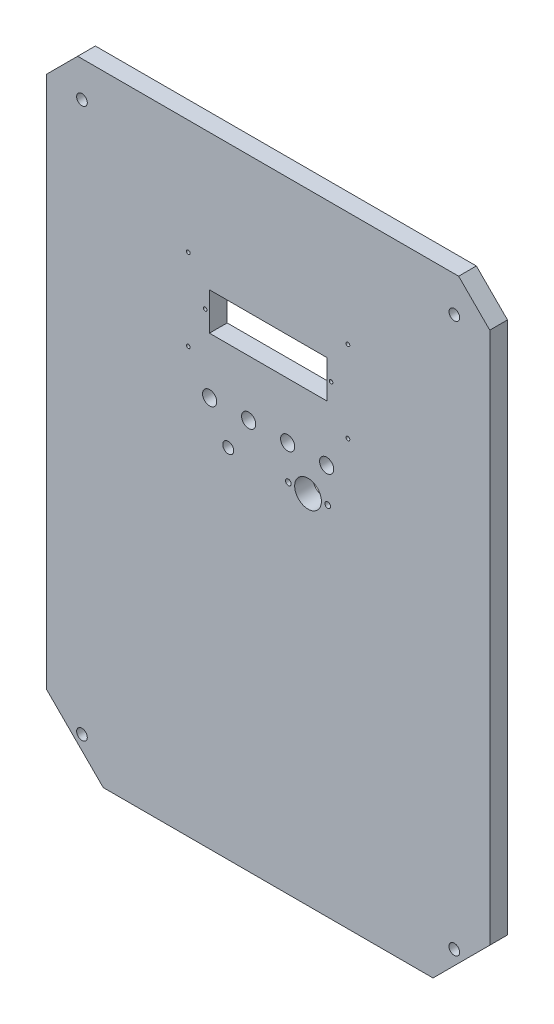
ISO-10303-21;
HEADER;
FILE_DESCRIPTION(('STEP AP214'),'2;1');
FILE_NAME('part.step','',(''),(''),'','','');
FILE_SCHEMA(('AUTOMOTIVE_DESIGN { 1 0 10303 214 1 1 1 1 }'));
ENDSEC;
DATA;
#1=APPLICATION_CONTEXT('core data for automotive mechanical design processes');
#2=APPLICATION_PROTOCOL_DEFINITION('international standard','automotive_design',2000,#1);
#3=PRODUCT_CONTEXT('',#1,'mechanical');
#4=PRODUCT('Part','Part','',(#3));
#5=PRODUCT_RELATED_PRODUCT_CATEGORY('part','',(#4));
#6=PRODUCT_DEFINITION_FORMATION('','',#4);
#7=PRODUCT_DEFINITION_CONTEXT('part definition',#1,'design');
#8=PRODUCT_DEFINITION('design','',#6,#7);
#9=PRODUCT_DEFINITION_SHAPE('','',#8);
#10=(LENGTH_UNIT() NAMED_UNIT(*) SI_UNIT(.MILLI.,.METRE.));
#11=(NAMED_UNIT(*) PLANE_ANGLE_UNIT() SI_UNIT($,.RADIAN.));
#12=(NAMED_UNIT(*) SI_UNIT($,.STERADIAN.) SOLID_ANGLE_UNIT());
#13=UNCERTAINTY_MEASURE_WITH_UNIT(LENGTH_MEASURE(1.E-05),#10,'distance_accuracy_value','');
#14=(GEOMETRIC_REPRESENTATION_CONTEXT(3) GLOBAL_UNCERTAINTY_ASSIGNED_CONTEXT((#13)) GLOBAL_UNIT_ASSIGNED_CONTEXT((#10,
#11,#12)) REPRESENTATION_CONTEXT('',''));
#15=CARTESIAN_POINT('',(0.,0.,0.));
#16=DIRECTION('',(0.,0.,1.));
#17=DIRECTION('',(1.,0.,0.));
#18=AXIS2_PLACEMENT_3D('',#15,#16,#17);
#19=CARTESIAN_POINT('',(939.601426779107,522.610093658204,10.));
#20=DIRECTION('',(0.,0.,1.));
#21=DIRECTION('',(1.,0.,0.));
#22=AXIS2_PLACEMENT_3D('',#19,#20,#21);
#23=PLANE('',#22);
#24=CARTESIAN_POINT('',(781.601426779108,743.015433658205,10.));
#25=DIRECTION('',(0.,0.,1.));
#26=DIRECTION('',(1.,0.,0.));
#27=AXIS2_PLACEMENT_3D('',#24,#25,#26);
#28=CIRCLE('',#27,3.99999999999999);
#29=CARTESIAN_POINT('',(785.601426779108,743.015433658205,10.));
#30=VERTEX_POINT('',#29);
#31=EDGE_CURVE('E370',#30,#30,#28,.T.);
#32=ORIENTED_EDGE('',*,*,#31,.F.);
#33=EDGE_LOOP('',(#32));
#34=FACE_BOUND('',#33,.T.);
#35=CARTESIAN_POINT('',(825.601426779108,743.015433658205,10.));
#36=DIRECTION('',(0.,0.,1.));
#37=DIRECTION('',(1.,0.,0.));
#38=AXIS2_PLACEMENT_3D('',#35,#36,#37);
#39=CIRCLE('',#38,3.99999999999999);
#40=CARTESIAN_POINT('',(829.601426779108,743.015433658205,10.));
#41=VERTEX_POINT('',#40);
#42=EDGE_CURVE('E380',#41,#41,#39,.T.);
#43=ORIENTED_EDGE('',*,*,#42,.F.);
#44=EDGE_LOOP('',(#43));
#45=FACE_BOUND('',#44,.T.);
#46=CARTESIAN_POINT('',(848.201426779108,723.920773658205,10.));
#47=DIRECTION('',(0.,0.,1.));
#48=DIRECTION('',(1.,0.,0.));
#49=AXIS2_PLACEMENT_3D('',#46,#47,#48);
#50=CIRCLE('',#49,1.60000000000003);
#51=CARTESIAN_POINT('',(849.801426779108,723.920773658205,10.));
#52=VERTEX_POINT('',#51);
#53=EDGE_CURVE('E390',#52,#52,#50,.T.);
#54=ORIENTED_EDGE('',*,*,#53,.F.);
#55=EDGE_LOOP('',(#54));
#56=FACE_BOUND('',#55,.T.);
#57=CARTESIAN_POINT('',(837.101426779108,723.920773658205,10.));
#58=DIRECTION('',(0.,0.,1.));
#59=DIRECTION('',(1.,0.,0.));
#60=AXIS2_PLACEMENT_3D('',#57,#58,#59);
#61=CIRCLE('',#60,7.54999999999997);
#62=CARTESIAN_POINT('',(844.651426779108,723.920773658205,10.));
#63=VERTEX_POINT('',#62);
#64=EDGE_CURVE('E400',#63,#63,#61,.T.);
#65=ORIENTED_EDGE('',*,*,#64,.F.);
#66=EDGE_LOOP('',(#65));
#67=FACE_BOUND('',#66,.T.);
#68=CARTESIAN_POINT('',(850.101426779108,785.110093658205,10.));
#69=DIRECTION('',(0.,0.,1.));
#70=DIRECTION('',(1.,0.,0.));
#71=AXIS2_PLACEMENT_3D('',#68,#69,#70);
#72=CIRCLE('',#71,0.999999999999945);
#73=CARTESIAN_POINT('',(851.101426779108,785.110093658205,10.));
#74=VERTEX_POINT('',#73);
#75=EDGE_CURVE('E149',#74,#74,#72,.T.);
#76=ORIENTED_EDGE('',*,*,#75,.F.);
#77=EDGE_LOOP('',(#76));
#78=FACE_BOUND('',#77,.T.);
#79=CARTESIAN_POINT('',(859.601426779108,762.110093658205,10.));
#80=DIRECTION('',(0.,0.,1.));
#81=DIRECTION('',(-1.,0.,0.));
#82=AXIS2_PLACEMENT_3D('',#79,#80,#81);
#83=CIRCLE('',#82,1.04999999999996);
#84=CARTESIAN_POINT('',(858.551426779108,762.110093658205,10.));
#85=VERTEX_POINT('',#84);
#86=EDGE_CURVE('E159',#85,#85,#83,.T.);
#87=ORIENTED_EDGE('',*,*,#86,.F.);
#88=EDGE_LOOP('',(#87));
#89=FACE_BOUND('',#88,.T.);
#90=CARTESIAN_POINT('',(769.601426779108,808.110093658205,10.));
#91=DIRECTION('',(0.,0.,1.));
#92=DIRECTION('',(-1.,0.,0.));
#93=AXIS2_PLACEMENT_3D('',#90,#91,#92);
#94=CIRCLE('',#93,1.04999999999996);
#95=CARTESIAN_POINT('',(768.551426779108,808.110093658205,10.));
#96=VERTEX_POINT('',#95);
#97=EDGE_CURVE('E171',#96,#96,#94,.T.);
#98=ORIENTED_EDGE('',*,*,#97,.F.);
#99=EDGE_LOOP('',(#98));
#100=FACE_BOUND('',#99,.T.);
#101=CARTESIAN_POINT('',(919.601426779107,542.610093658204,10.));
#102=DIRECTION('',(0.,0.,1.));
#103=DIRECTION('',(1.,0.,0.));
#104=AXIS2_PLACEMENT_3D('',#101,#102,#103);
#105=CIRCLE('',#104,3.00000000000096);
#106=CARTESIAN_POINT('',(922.601426779108,542.610093658204,10.));
#107=VERTEX_POINT('',#106);
#108=EDGE_CURVE('E183',#107,#107,#105,.T.);
#109=ORIENTED_EDGE('',*,*,#108,.F.);
#110=EDGE_LOOP('',(#109));
#111=FACE_BOUND('',#110,.T.);
#112=CARTESIAN_POINT('',(709.601426779108,852.610093658205,10.));
#113=DIRECTION('',(0.,0.,1.));
#114=DIRECTION('',(1.,0.,0.));
#115=AXIS2_PLACEMENT_3D('',#112,#113,#114);
#116=CIRCLE('',#115,2.99999999999995);
#117=CARTESIAN_POINT('',(712.601426779108,852.610093658205,10.));
#118=VERTEX_POINT('',#117);
#119=EDGE_CURVE('E195',#118,#118,#116,.T.);
#120=ORIENTED_EDGE('',*,*,#119,.F.);
#121=EDGE_LOOP('',(#120));
#122=FACE_BOUND('',#121,.T.);
#123=DIRECTION('',(1.,0.,0.));
#124=VECTOR('',#123,1.);
#125=CARTESIAN_POINT('',(721.601426779107,522.610093658204,10.));
#126=LINE('',#125,#124);
#127=CARTESIAN_POINT('',(721.601426779107,522.610093658204,10.));
#128=VERTEX_POINT('',#127);
#129=CARTESIAN_POINT('',(907.601426779108,522.610093658204,10.));
#130=VERTEX_POINT('',#129);
#131=EDGE_CURVE('E207',#128,#130,#126,.T.);
#132=ORIENTED_EDGE('',*,*,#131,.T.);
#133=DIRECTION('',(0.707106781186544,0.707106781186551,0.));
#134=VECTOR('',#133,1.);
#135=CARTESIAN_POINT('',(907.601426779108,522.610093658204,10.));
#136=LINE('',#135,#134);
#137=CARTESIAN_POINT('',(939.601426779107,554.610093658204,10.));
#138=VERTEX_POINT('',#137);
#139=EDGE_CURVE('E210',#130,#138,#136,.T.);
#140=ORIENTED_EDGE('',*,*,#139,.T.);
#141=DIRECTION('',(0.,1.,0.));
#142=VECTOR('',#141,1.);
#143=CARTESIAN_POINT('',(939.601426779107,554.610093658204,10.));
#144=LINE('',#143,#142);
#145=CARTESIAN_POINT('',(939.601426779108,855.042708992512,10.));
#146=VERTEX_POINT('',#145);
#147=EDGE_CURVE('E213',#138,#146,#144,.T.);
#148=ORIENTED_EDGE('',*,*,#147,.T.);
#149=DIRECTION('',(-0.707106781186543,0.707106781186552,0.));
#150=VECTOR('',#149,1.);
#151=CARTESIAN_POINT('',(939.601426779108,855.042708992512,10.));
#152=LINE('',#151,#150);
#153=CARTESIAN_POINT('',(922.034042113416,872.610093658205,10.));
#154=VERTEX_POINT('',#153);
#155=EDGE_CURVE('E215',#146,#154,#152,.T.);
#156=ORIENTED_EDGE('',*,*,#155,.T.);
#157=DIRECTION('',(-1.,0.,0.));
#158=VECTOR('',#157,1.);
#159=CARTESIAN_POINT('',(922.034042113416,872.610093658205,10.));
#160=LINE('',#159,#158);
#161=CARTESIAN_POINT('',(707.1688114448,872.610093658205,10.));
#162=VERTEX_POINT('',#161);
#163=EDGE_CURVE('E217',#154,#162,#160,.T.);
#164=ORIENTED_EDGE('',*,*,#163,.T.);
#165=DIRECTION('',(-0.707106781186543,-0.707106781186552,0.));
#166=VECTOR('',#165,1.);
#167=CARTESIAN_POINT('',(707.1688114448,872.610093658205,10.));
#168=LINE('',#167,#166);
#169=CARTESIAN_POINT('',(689.601426779108,855.042708992512,10.));
#170=VERTEX_POINT('',#169);
#171=EDGE_CURVE('E219',#162,#170,#168,.T.);
#172=ORIENTED_EDGE('',*,*,#171,.T.);
#173=DIRECTION('',(0.,-1.,0.));
#174=VECTOR('',#173,1.);
#175=CARTESIAN_POINT('',(689.601426779108,855.042708992512,10.));
#176=LINE('',#175,#174);
#177=CARTESIAN_POINT('',(689.601426779108,554.610093658205,10.));
#178=VERTEX_POINT('',#177);
#179=EDGE_CURVE('E221',#170,#178,#176,.T.);
#180=ORIENTED_EDGE('',*,*,#179,.T.);
#181=DIRECTION('',(0.707106781186541,-0.707106781186554,0.));
#182=VECTOR('',#181,1.);
#183=CARTESIAN_POINT('',(689.601426779108,554.610093658205,10.));
#184=LINE('',#183,#182);
#185=EDGE_CURVE('E223',#178,#128,#184,.T.);
#186=ORIENTED_EDGE('',*,*,#185,.T.);
#187=EDGE_LOOP('',(#132,#140,#148,#156,#164,#172,#180,#186));
#188=FACE_BOUND('',#187,.T.);
#189=CARTESIAN_POINT('',(709.601426779107,542.610093658205,10.));
#190=DIRECTION('',(0.,0.,1.));
#191=DIRECTION('',(1.,0.,0.));
#192=AXIS2_PLACEMENT_3D('',#189,#190,#191);
#193=CIRCLE('',#192,3.00000000000051);
#194=CARTESIAN_POINT('',(712.601426779108,542.610093658205,10.));
#195=VERTEX_POINT('',#194);
#196=EDGE_CURVE('E201',#195,#195,#193,.T.);
#197=ORIENTED_EDGE('',*,*,#196,.F.);
#198=EDGE_LOOP('',(#197));
#199=FACE_BOUND('',#198,.T.);
#200=CARTESIAN_POINT('',(919.601426779108,852.610093658204,10.));
#201=DIRECTION('',(0.,0.,1.));
#202=DIRECTION('',(1.,0.,0.));
#203=AXIS2_PLACEMENT_3D('',#200,#201,#202);
#204=CIRCLE('',#203,2.9999999999999);
#205=CARTESIAN_POINT('',(922.601426779108,852.610093658204,10.));
#206=VERTEX_POINT('',#205);
#207=EDGE_CURVE('E189',#206,#206,#204,.T.);
#208=ORIENTED_EDGE('',*,*,#207,.F.);
#209=EDGE_LOOP('',(#208));
#210=FACE_BOUND('',#209,.T.);
#211=CARTESIAN_POINT('',(859.601426779108,808.110093658205,10.));
#212=DIRECTION('',(0.,0.,1.));
#213=DIRECTION('',(1.,0.,0.));
#214=AXIS2_PLACEMENT_3D('',#211,#212,#213);
#215=CIRCLE('',#214,1.04999999999975);
#216=CARTESIAN_POINT('',(860.651426779108,808.110093658205,10.));
#217=VERTEX_POINT('',#216);
#218=EDGE_CURVE('E177',#217,#217,#215,.T.);
#219=ORIENTED_EDGE('',*,*,#218,.F.);
#220=EDGE_LOOP('',(#219));
#221=FACE_BOUND('',#220,.T.);
#222=CARTESIAN_POINT('',(769.601426779108,762.110093658205,10.));
#223=DIRECTION('',(0.,0.,1.));
#224=DIRECTION('',(1.,0.,0.));
#225=AXIS2_PLACEMENT_3D('',#222,#223,#224);
#226=CIRCLE('',#225,1.04999999999996);
#227=CARTESIAN_POINT('',(770.651426779108,762.110093658205,10.));
#228=VERTEX_POINT('',#227);
#229=EDGE_CURVE('E165',#228,#228,#226,.T.);
#230=ORIENTED_EDGE('',*,*,#229,.F.);
#231=EDGE_LOOP('',(#230));
#232=FACE_BOUND('',#231,.T.);
#233=DIRECTION('',(1.,0.,0.));
#234=VECTOR('',#233,1.);
#235=CARTESIAN_POINT('',(847.701426779108,774.510093658205,10.));
#236=LINE('',#235,#234);
#237=CARTESIAN_POINT('',(781.501426779108,774.510093658205,10.));
#238=VERTEX_POINT('',#237);
#239=CARTESIAN_POINT('',(847.701426779108,774.510093658205,10.));
#240=VERTEX_POINT('',#239);
#241=EDGE_CURVE('E128',#238,#240,#236,.T.);
#242=ORIENTED_EDGE('',*,*,#241,.F.);
#243=DIRECTION('',(0.,-1.,0.));
#244=VECTOR('',#243,1.);
#245=CARTESIAN_POINT('',(781.501426779108,795.710093658205,10.));
#246=LINE('',#245,#244);
#247=CARTESIAN_POINT('',(781.501426779108,795.710093658205,10.));
#248=VERTEX_POINT('',#247);
#249=EDGE_CURVE('E120',#248,#238,#246,.T.);
#250=ORIENTED_EDGE('',*,*,#249,.F.);
#251=DIRECTION('',(-1.,0.,0.));
#252=VECTOR('',#251,1.);
#253=CARTESIAN_POINT('',(847.701426779108,795.710093658205,10.));
#254=LINE('',#253,#252);
#255=CARTESIAN_POINT('',(847.701426779108,795.710093658205,10.));
#256=VERTEX_POINT('',#255);
#257=EDGE_CURVE('E143',#256,#248,#254,.T.);
#258=ORIENTED_EDGE('',*,*,#257,.F.);
#259=DIRECTION('',(0.,1.,0.));
#260=VECTOR('',#259,1.);
#261=CARTESIAN_POINT('',(847.701426779108,795.710093658205,10.));
#262=LINE('',#261,#260);
#263=EDGE_CURVE('E141',#240,#256,#262,.T.);
#264=ORIENTED_EDGE('',*,*,#263,.F.);
#265=EDGE_LOOP('',(#242,#250,#258,#264));
#266=FACE_BOUND('',#265,.T.);
#267=CARTESIAN_POINT('',(779.101426779108,785.110093658205,10.));
#268=DIRECTION('',(0.,0.,1.));
#269=DIRECTION('',(-1.,0.,0.));
#270=AXIS2_PLACEMENT_3D('',#267,#268,#269);
#271=CIRCLE('',#270,1.00000000000005);
#272=CARTESIAN_POINT('',(778.101426779108,785.110093658205,10.));
#273=VERTEX_POINT('',#272);
#274=EDGE_CURVE('E405',#273,#273,#271,.T.);
#275=ORIENTED_EDGE('',*,*,#274,.F.);
#276=EDGE_LOOP('',(#275));
#277=FACE_BOUND('',#276,.T.);
#278=CARTESIAN_POINT('',(847.601426779108,743.015433658205,10.));
#279=DIRECTION('',(0.,0.,1.));
#280=DIRECTION('',(1.,0.,0.));
#281=AXIS2_PLACEMENT_3D('',#278,#279,#280);
#282=CIRCLE('',#281,3.99999999999999);
#283=CARTESIAN_POINT('',(851.601426779108,743.015433658205,10.));
#284=VERTEX_POINT('',#283);
#285=EDGE_CURVE('E395',#284,#284,#282,.T.);
#286=ORIENTED_EDGE('',*,*,#285,.F.);
#287=EDGE_LOOP('',(#286));
#288=FACE_BOUND('',#287,.T.);
#289=CARTESIAN_POINT('',(826.001426779108,723.920773658205,10.));
#290=DIRECTION('',(0.,0.,1.));
#291=DIRECTION('',(1.,0.,0.));
#292=AXIS2_PLACEMENT_3D('',#289,#290,#291);
#293=CIRCLE('',#292,1.60000000000003);
#294=CARTESIAN_POINT('',(827.601426779108,723.920773658205,10.));
#295=VERTEX_POINT('',#294);
#296=EDGE_CURVE('E385',#295,#295,#293,.T.);
#297=ORIENTED_EDGE('',*,*,#296,.F.);
#298=EDGE_LOOP('',(#297));
#299=FACE_BOUND('',#298,.T.);
#300=CARTESIAN_POINT('',(803.601426779108,743.015433658205,10.));
#301=DIRECTION('',(0.,0.,1.));
#302=DIRECTION('',(1.,0.,0.));
#303=AXIS2_PLACEMENT_3D('',#300,#301,#302);
#304=CIRCLE('',#303,3.99999999999999);
#305=CARTESIAN_POINT('',(807.601426779108,743.015433658205,10.));
#306=VERTEX_POINT('',#305);
#307=EDGE_CURVE('E375',#306,#306,#304,.T.);
#308=ORIENTED_EDGE('',*,*,#307,.F.);
#309=EDGE_LOOP('',(#308));
#310=FACE_BOUND('',#309,.T.);
#311=CARTESIAN_POINT('',(792.101426779108,723.920773658205,10.));
#312=DIRECTION('',(0.,0.,1.));
#313=DIRECTION('',(1.,0.,0.));
#314=AXIS2_PLACEMENT_3D('',#311,#312,#313);
#315=CIRCLE('',#314,3.1);
#316=CARTESIAN_POINT('',(795.201426779108,723.920773658205,10.));
#317=VERTEX_POINT('',#316);
#318=EDGE_CURVE('E364',#317,#317,#315,.T.);
#319=ORIENTED_EDGE('',*,*,#318,.F.);
#320=EDGE_LOOP('',(#319));
#321=FACE_BOUND('',#320,.T.);
#322=ADVANCED_FACE('F31',(#34,#45,#56,#67,#78,#89,#100,#111,#122,#188,#199,#210,#221,#232,#266,
#277,#288,#299,#310,#321),#23,.T.);
#323=CARTESIAN_POINT('',(939.601426779107,522.610093658204,0.));
#324=DIRECTION('',(0.,0.,1.));
#325=DIRECTION('',(1.,0.,0.));
#326=AXIS2_PLACEMENT_3D('',#323,#324,#325);
#327=PLANE('',#326);
#328=CARTESIAN_POINT('',(781.601426779108,743.015433658205,0.));
#329=DIRECTION('',(0.,0.,1.));
#330=DIRECTION('',(1.,0.,0.));
#331=AXIS2_PLACEMENT_3D('',#328,#329,#330);
#332=CIRCLE('',#331,3.99999999999999);
#333=CARTESIAN_POINT('',(785.601426779108,743.015433658205,0.));
#334=VERTEX_POINT('',#333);
#335=EDGE_CURVE('E367',#334,#334,#332,.T.);
#336=ORIENTED_EDGE('',*,*,#335,.T.);
#337=EDGE_LOOP('',(#336));
#338=FACE_BOUND('',#337,.T.);
#339=CARTESIAN_POINT('',(825.601426779108,743.015433658205,0.));
#340=DIRECTION('',(0.,0.,1.));
#341=DIRECTION('',(1.,0.,0.));
#342=AXIS2_PLACEMENT_3D('',#339,#340,#341);
#343=CIRCLE('',#342,3.99999999999999);
#344=CARTESIAN_POINT('',(829.601426779108,743.015433658205,0.));
#345=VERTEX_POINT('',#344);
#346=EDGE_CURVE('E378',#345,#345,#343,.T.);
#347=ORIENTED_EDGE('',*,*,#346,.T.);
#348=EDGE_LOOP('',(#347));
#349=FACE_BOUND('',#348,.T.);
#350=CARTESIAN_POINT('',(848.201426779108,723.920773658205,0.));
#351=DIRECTION('',(0.,0.,1.));
#352=DIRECTION('',(1.,0.,0.));
#353=AXIS2_PLACEMENT_3D('',#350,#351,#352);
#354=CIRCLE('',#353,1.60000000000003);
#355=CARTESIAN_POINT('',(849.801426779108,723.920773658205,0.));
#356=VERTEX_POINT('',#355);
#357=EDGE_CURVE('E388',#356,#356,#354,.T.);
#358=ORIENTED_EDGE('',*,*,#357,.T.);
#359=EDGE_LOOP('',(#358));
#360=FACE_BOUND('',#359,.T.);
#361=CARTESIAN_POINT('',(837.101426779108,723.920773658205,0.));
#362=DIRECTION('',(0.,0.,1.));
#363=DIRECTION('',(1.,0.,0.));
#364=AXIS2_PLACEMENT_3D('',#361,#362,#363);
#365=CIRCLE('',#364,7.54999999999997);
#366=CARTESIAN_POINT('',(844.651426779108,723.920773658205,0.));
#367=VERTEX_POINT('',#366);
#368=EDGE_CURVE('E398',#367,#367,#365,.T.);
#369=ORIENTED_EDGE('',*,*,#368,.T.);
#370=EDGE_LOOP('',(#369));
#371=FACE_BOUND('',#370,.T.);
#372=CARTESIAN_POINT('',(850.101426779108,785.110093658205,0.));
#373=DIRECTION('',(0.,0.,1.));
#374=DIRECTION('',(1.,0.,0.));
#375=AXIS2_PLACEMENT_3D('',#372,#373,#374);
#376=CIRCLE('',#375,0.999999999999945);
#377=CARTESIAN_POINT('',(851.101426779108,785.110093658205,0.));
#378=VERTEX_POINT('',#377);
#379=EDGE_CURVE('E408',#378,#378,#376,.T.);
#380=ORIENTED_EDGE('',*,*,#379,.T.);
#381=EDGE_LOOP('',(#380));
#382=FACE_BOUND('',#381,.T.);
#383=CARTESIAN_POINT('',(859.601426779108,762.110093658205,0.));
#384=DIRECTION('',(0.,0.,1.));
#385=DIRECTION('',(-1.,0.,0.));
#386=AXIS2_PLACEMENT_3D('',#383,#384,#385);
#387=CIRCLE('',#386,1.04999999999996);
#388=CARTESIAN_POINT('',(858.551426779108,762.110093658205,0.));
#389=VERTEX_POINT('',#388);
#390=EDGE_CURVE('E136',#389,#389,#387,.T.);
#391=ORIENTED_EDGE('',*,*,#390,.T.);
#392=EDGE_LOOP('',(#391));
#393=FACE_BOUND('',#392,.T.);
#394=CARTESIAN_POINT('',(769.601426779108,808.110093658205,0.));
#395=DIRECTION('',(0.,0.,1.));
#396=DIRECTION('',(-1.,0.,0.));
#397=AXIS2_PLACEMENT_3D('',#394,#395,#396);
#398=CIRCLE('',#397,1.04999999999996);
#399=CARTESIAN_POINT('',(768.551426779108,808.110093658205,0.));
#400=VERTEX_POINT('',#399);
#401=EDGE_CURVE('E168',#400,#400,#398,.T.);
#402=ORIENTED_EDGE('',*,*,#401,.T.);
#403=EDGE_LOOP('',(#402));
#404=FACE_BOUND('',#403,.T.);
#405=CARTESIAN_POINT('',(919.601426779107,542.610093658204,0.));
#406=DIRECTION('',(0.,0.,1.));
#407=DIRECTION('',(1.,0.,0.));
#408=AXIS2_PLACEMENT_3D('',#405,#406,#407);
#409=CIRCLE('',#408,3.00000000000096);
#410=CARTESIAN_POINT('',(922.601426779108,542.610093658204,0.));
#411=VERTEX_POINT('',#410);
#412=EDGE_CURVE('E180',#411,#411,#409,.T.);
#413=ORIENTED_EDGE('',*,*,#412,.T.);
#414=EDGE_LOOP('',(#413));
#415=FACE_BOUND('',#414,.T.);
#416=CARTESIAN_POINT('',(709.601426779108,852.610093658205,0.));
#417=DIRECTION('',(0.,0.,1.));
#418=DIRECTION('',(1.,0.,0.));
#419=AXIS2_PLACEMENT_3D('',#416,#417,#418);
#420=CIRCLE('',#419,2.99999999999995);
#421=CARTESIAN_POINT('',(712.601426779108,852.610093658205,0.));
#422=VERTEX_POINT('',#421);
#423=EDGE_CURVE('E192',#422,#422,#420,.T.);
#424=ORIENTED_EDGE('',*,*,#423,.T.);
#425=EDGE_LOOP('',(#424));
#426=FACE_BOUND('',#425,.T.);
#427=DIRECTION('',(1.,0.,0.));
#428=VECTOR('',#427,1.);
#429=CARTESIAN_POINT('',(721.601426779107,522.610093658204,0.));
#430=LINE('',#429,#428);
#431=CARTESIAN_POINT('',(721.601426779107,522.610093658204,0.));
#432=VERTEX_POINT('',#431);
#433=CARTESIAN_POINT('',(907.601426779108,522.610093658204,0.));
#434=VERTEX_POINT('',#433);
#435=EDGE_CURVE('E204',#432,#434,#430,.T.);
#436=ORIENTED_EDGE('',*,*,#435,.F.);
#437=DIRECTION('',(0.707106781186541,-0.707106781186554,0.));
#438=VECTOR('',#437,1.);
#439=CARTESIAN_POINT('',(689.601426779108,554.610093658205,0.));
#440=LINE('',#439,#438);
#441=CARTESIAN_POINT('',(689.601426779108,554.610093658205,0.));
#442=VERTEX_POINT('',#441);
#443=EDGE_CURVE('E211',#442,#432,#440,.T.);
#444=ORIENTED_EDGE('',*,*,#443,.F.);
#445=DIRECTION('',(0.,-1.,0.));
#446=VECTOR('',#445,1.);
#447=CARTESIAN_POINT('',(689.601426779108,855.042708992512,0.));
#448=LINE('',#447,#446);
#449=CARTESIAN_POINT('',(689.601426779108,855.042708992512,0.));
#450=VERTEX_POINT('',#449);
#451=EDGE_CURVE('E238',#450,#442,#448,.T.);
#452=ORIENTED_EDGE('',*,*,#451,.F.);
#453=DIRECTION('',(-0.707106781186543,-0.707106781186552,0.));
#454=VECTOR('',#453,1.);
#455=CARTESIAN_POINT('',(707.1688114448,872.610093658205,0.));
#456=LINE('',#455,#454);
#457=CARTESIAN_POINT('',(707.1688114448,872.610093658205,0.));
#458=VERTEX_POINT('',#457);
#459=EDGE_CURVE('E236',#458,#450,#456,.T.);
#460=ORIENTED_EDGE('',*,*,#459,.F.);
#461=DIRECTION('',(-1.,0.,0.));
#462=VECTOR('',#461,1.);
#463=CARTESIAN_POINT('',(922.034042113416,872.610093658205,0.));
#464=LINE('',#463,#462);
#465=CARTESIAN_POINT('',(922.034042113416,872.610093658205,0.));
#466=VERTEX_POINT('',#465);
#467=EDGE_CURVE('E234',#466,#458,#464,.T.);
#468=ORIENTED_EDGE('',*,*,#467,.F.);
#469=DIRECTION('',(-0.707106781186543,0.707106781186552,0.));
#470=VECTOR('',#469,1.);
#471=CARTESIAN_POINT('',(939.601426779108,855.042708992512,0.));
#472=LINE('',#471,#470);
#473=CARTESIAN_POINT('',(939.601426779108,855.042708992512,0.));
#474=VERTEX_POINT('',#473);
#475=EDGE_CURVE('E232',#474,#466,#472,.T.);
#476=ORIENTED_EDGE('',*,*,#475,.F.);
#477=DIRECTION('',(0.,1.,0.));
#478=VECTOR('',#477,1.);
#479=CARTESIAN_POINT('',(939.601426779107,554.610093658204,0.));
#480=LINE('',#479,#478);
#481=CARTESIAN_POINT('',(939.601426779107,554.610093658204,0.));
#482=VERTEX_POINT('',#481);
#483=EDGE_CURVE('E230',#482,#474,#480,.T.);
#484=ORIENTED_EDGE('',*,*,#483,.F.);
#485=DIRECTION('',(0.707106781186544,0.707106781186551,0.));
#486=VECTOR('',#485,1.);
#487=CARTESIAN_POINT('',(907.601426779108,522.610093658204,0.));
#488=LINE('',#487,#486);
#489=EDGE_CURVE('E228',#434,#482,#488,.T.);
#490=ORIENTED_EDGE('',*,*,#489,.F.);
#491=EDGE_LOOP('',(#436,#444,#452,#460,#468,#476,#484,#490));
#492=FACE_BOUND('',#491,.T.);
#493=CARTESIAN_POINT('',(709.601426779107,542.610093658205,0.));
#494=DIRECTION('',(0.,0.,1.));
#495=DIRECTION('',(1.,0.,0.));
#496=AXIS2_PLACEMENT_3D('',#493,#494,#495);
#497=CIRCLE('',#496,3.00000000000051);
#498=CARTESIAN_POINT('',(712.601426779108,542.610093658205,0.));
#499=VERTEX_POINT('',#498);
#500=EDGE_CURVE('E198',#499,#499,#497,.T.);
#501=ORIENTED_EDGE('',*,*,#500,.T.);
#502=EDGE_LOOP('',(#501));
#503=FACE_BOUND('',#502,.T.);
#504=CARTESIAN_POINT('',(919.601426779108,852.610093658204,0.));
#505=DIRECTION('',(0.,0.,1.));
#506=DIRECTION('',(1.,0.,0.));
#507=AXIS2_PLACEMENT_3D('',#504,#505,#506);
#508=CIRCLE('',#507,2.9999999999999);
#509=CARTESIAN_POINT('',(922.601426779108,852.610093658204,0.));
#510=VERTEX_POINT('',#509);
#511=EDGE_CURVE('E186',#510,#510,#508,.T.);
#512=ORIENTED_EDGE('',*,*,#511,.T.);
#513=EDGE_LOOP('',(#512));
#514=FACE_BOUND('',#513,.T.);
#515=CARTESIAN_POINT('',(859.601426779108,808.110093658205,0.));
#516=DIRECTION('',(0.,0.,1.));
#517=DIRECTION('',(1.,0.,0.));
#518=AXIS2_PLACEMENT_3D('',#515,#516,#517);
#519=CIRCLE('',#518,1.04999999999975);
#520=CARTESIAN_POINT('',(860.651426779108,808.110093658205,0.));
#521=VERTEX_POINT('',#520);
#522=EDGE_CURVE('E174',#521,#521,#519,.T.);
#523=ORIENTED_EDGE('',*,*,#522,.T.);
#524=EDGE_LOOP('',(#523));
#525=FACE_BOUND('',#524,.T.);
#526=CARTESIAN_POINT('',(769.601426779108,762.110093658205,0.));
#527=DIRECTION('',(0.,0.,1.));
#528=DIRECTION('',(1.,0.,0.));
#529=AXIS2_PLACEMENT_3D('',#526,#527,#528);
#530=CIRCLE('',#529,1.04999999999996);
#531=CARTESIAN_POINT('',(770.651426779108,762.110093658205,0.));
#532=VERTEX_POINT('',#531);
#533=EDGE_CURVE('E162',#532,#532,#530,.T.);
#534=ORIENTED_EDGE('',*,*,#533,.T.);
#535=EDGE_LOOP('',(#534));
#536=FACE_BOUND('',#535,.T.);
#537=DIRECTION('',(0.,-1.,0.));
#538=VECTOR('',#537,1.);
#539=CARTESIAN_POINT('',(781.501426779108,795.710093658205,0.));
#540=LINE('',#539,#538);
#541=CARTESIAN_POINT('',(781.501426779108,795.710093658205,0.));
#542=VERTEX_POINT('',#541);
#543=CARTESIAN_POINT('',(781.501426779108,774.510093658205,0.));
#544=VERTEX_POINT('',#543);
#545=EDGE_CURVE('E54',#542,#544,#540,.T.);
#546=ORIENTED_EDGE('',*,*,#545,.T.);
#547=DIRECTION('',(1.,0.,0.));
#548=VECTOR('',#547,1.);
#549=CARTESIAN_POINT('',(847.701426779108,774.510093658205,0.));
#550=LINE('',#549,#548);
#551=CARTESIAN_POINT('',(847.701426779108,774.510093658205,0.));
#552=VERTEX_POINT('',#551);
#553=EDGE_CURVE('E135',#544,#552,#550,.T.);
#554=ORIENTED_EDGE('',*,*,#553,.T.);
#555=DIRECTION('',(0.,1.,0.));
#556=VECTOR('',#555,1.);
#557=CARTESIAN_POINT('',(847.701426779108,795.710093658205,0.));
#558=LINE('',#557,#556);
#559=CARTESIAN_POINT('',(847.701426779108,795.710093658205,0.));
#560=VERTEX_POINT('',#559);
#561=EDGE_CURVE('E151',#552,#560,#558,.T.);
#562=ORIENTED_EDGE('',*,*,#561,.T.);
#563=DIRECTION('',(-1.,0.,0.));
#564=VECTOR('',#563,1.);
#565=CARTESIAN_POINT('',(847.701426779108,795.710093658205,0.));
#566=LINE('',#565,#564);
#567=EDGE_CURVE('E129',#560,#542,#566,.T.);
#568=ORIENTED_EDGE('',*,*,#567,.T.);
#569=EDGE_LOOP('',(#546,#554,#562,#568));
#570=FACE_BOUND('',#569,.T.);
#571=CARTESIAN_POINT('',(779.101426779108,785.110093658205,0.));
#572=DIRECTION('',(0.,0.,1.));
#573=DIRECTION('',(-1.,0.,0.));
#574=AXIS2_PLACEMENT_3D('',#571,#572,#573);
#575=CIRCLE('',#574,1.00000000000005);
#576=CARTESIAN_POINT('',(778.101426779108,785.110093658205,0.));
#577=VERTEX_POINT('',#576);
#578=EDGE_CURVE('E347',#577,#577,#575,.T.);
#579=ORIENTED_EDGE('',*,*,#578,.T.);
#580=EDGE_LOOP('',(#579));
#581=FACE_BOUND('',#580,.T.);
#582=CARTESIAN_POINT('',(847.601426779108,743.015433658205,0.));
#583=DIRECTION('',(0.,0.,1.));
#584=DIRECTION('',(1.,0.,0.));
#585=AXIS2_PLACEMENT_3D('',#582,#583,#584);
#586=CIRCLE('',#585,3.99999999999999);
#587=CARTESIAN_POINT('',(851.601426779108,743.015433658205,0.));
#588=VERTEX_POINT('',#587);
#589=EDGE_CURVE('E351',#588,#588,#586,.T.);
#590=ORIENTED_EDGE('',*,*,#589,.T.);
#591=EDGE_LOOP('',(#590));
#592=FACE_BOUND('',#591,.T.);
#593=CARTESIAN_POINT('',(826.001426779108,723.920773658205,0.));
#594=DIRECTION('',(0.,0.,1.));
#595=DIRECTION('',(1.,0.,0.));
#596=AXIS2_PLACEMENT_3D('',#593,#594,#595);
#597=CIRCLE('',#596,1.60000000000003);
#598=CARTESIAN_POINT('',(827.601426779108,723.920773658205,0.));
#599=VERTEX_POINT('',#598);
#600=EDGE_CURVE('E355',#599,#599,#597,.T.);
#601=ORIENTED_EDGE('',*,*,#600,.T.);
#602=EDGE_LOOP('',(#601));
#603=FACE_BOUND('',#602,.T.);
#604=CARTESIAN_POINT('',(803.601426779108,743.015433658205,0.));
#605=DIRECTION('',(0.,0.,1.));
#606=DIRECTION('',(1.,0.,0.));
#607=AXIS2_PLACEMENT_3D('',#604,#605,#606);
#608=CIRCLE('',#607,3.99999999999999);
#609=CARTESIAN_POINT('',(807.601426779108,743.015433658205,0.));
#610=VERTEX_POINT('',#609);
#611=EDGE_CURVE('E359',#610,#610,#608,.T.);
#612=ORIENTED_EDGE('',*,*,#611,.T.);
#613=EDGE_LOOP('',(#612));
#614=FACE_BOUND('',#613,.T.);
#615=CARTESIAN_POINT('',(792.101426779108,723.920773658205,0.));
#616=DIRECTION('',(0.,0.,1.));
#617=DIRECTION('',(1.,0.,0.));
#618=AXIS2_PLACEMENT_3D('',#615,#616,#617);
#619=CIRCLE('',#618,3.1);
#620=CARTESIAN_POINT('',(795.201426779108,723.920773658205,0.));
#621=VERTEX_POINT('',#620);
#622=EDGE_CURVE('E362',#621,#621,#619,.T.);
#623=ORIENTED_EDGE('',*,*,#622,.T.);
#624=EDGE_LOOP('',(#623));
#625=FACE_BOUND('',#624,.T.);
#626=ADVANCED_FACE('F268',(#338,#349,#360,#371,#382,#393,#404,#415,#426,#492,#503,#514,#525,
#536,#570,#581,#592,#603,#614,#625),#327,.F.);
#627=CARTESIAN_POINT('',(721.601426779107,522.610093658204,10.));
#628=DIRECTION('',(0.,1.,0.));
#629=DIRECTION('',(-1.,0.,0.));
#630=AXIS2_PLACEMENT_3D('',#627,#628,#629);
#631=PLANE('',#630);
#632=ORIENTED_EDGE('',*,*,#435,.T.);
#633=DIRECTION('',(0.,0.,-1.));
#634=VECTOR('',#633,1.);
#635=CARTESIAN_POINT('',(907.601426779108,522.610093658204,10.));
#636=LINE('',#635,#634);
#637=EDGE_CURVE('E11',#130,#434,#636,.T.);
#638=ORIENTED_EDGE('',*,*,#637,.F.);
#639=ORIENTED_EDGE('',*,*,#131,.F.);
#640=DIRECTION('',(0.,0.,-1.));
#641=VECTOR('',#640,1.);
#642=CARTESIAN_POINT('',(721.601426779107,522.610093658204,10.));
#643=LINE('',#642,#641);
#644=EDGE_CURVE('E225',#128,#432,#643,.T.);
#645=ORIENTED_EDGE('',*,*,#644,.T.);
#646=EDGE_LOOP('',(#632,#638,#639,#645));
#647=FACE_BOUND('',#646,.T.);
#648=ADVANCED_FACE('F33',(#647),#631,.F.);
#649=CARTESIAN_POINT('',(907.601426779108,522.610093658204,10.));
#650=DIRECTION('',(-0.707106781186551,0.707106781186544,0.));
#651=DIRECTION('',(-0.707106781186544,-0.707106781186551,0.));
#652=AXIS2_PLACEMENT_3D('',#649,#650,#651);
#653=PLANE('',#652);
#654=ORIENTED_EDGE('',*,*,#489,.T.);
#655=DIRECTION('',(0.,0.,-1.));
#656=VECTOR('',#655,1.);
#657=CARTESIAN_POINT('',(939.601426779107,554.610093658204,10.));
#658=LINE('',#657,#656);
#659=EDGE_CURVE('E39',#138,#482,#658,.T.);
#660=ORIENTED_EDGE('',*,*,#659,.F.);
#661=ORIENTED_EDGE('',*,*,#139,.F.);
#662=ORIENTED_EDGE('',*,*,#637,.T.);
#663=EDGE_LOOP('',(#654,#660,#661,#662));
#664=FACE_BOUND('',#663,.T.);
#665=ADVANCED_FACE('F286',(#664),#653,.F.);
#666=CARTESIAN_POINT('',(939.601426779107,554.610093658204,10.));
#667=DIRECTION('',(-1.,0.,0.));
#668=DIRECTION('',(0.,-1.,0.));
#669=AXIS2_PLACEMENT_3D('',#666,#667,#668);
#670=PLANE('',#669);
#671=ORIENTED_EDGE('',*,*,#483,.T.);
#672=DIRECTION('',(0.,0.,-1.));
#673=VECTOR('',#672,1.);
#674=CARTESIAN_POINT('',(939.601426779108,855.042708992512,10.));
#675=LINE('',#674,#673);
#676=EDGE_CURVE('E255',#146,#474,#675,.T.);
#677=ORIENTED_EDGE('',*,*,#676,.F.);
#678=ORIENTED_EDGE('',*,*,#147,.F.);
#679=ORIENTED_EDGE('',*,*,#659,.T.);
#680=EDGE_LOOP('',(#671,#677,#678,#679));
#681=FACE_BOUND('',#680,.T.);
#682=ADVANCED_FACE('F262',(#681),#670,.F.);
#683=CARTESIAN_POINT('',(939.601426779108,855.042708992512,10.));
#684=DIRECTION('',(-0.707106781186552,-0.707106781186543,0.));
#685=DIRECTION('',(0.707106781186543,-0.707106781186552,0.));
#686=AXIS2_PLACEMENT_3D('',#683,#684,#685);
#687=PLANE('',#686);
#688=ORIENTED_EDGE('',*,*,#475,.T.);
#689=DIRECTION('',(0.,0.,-1.));
#690=VECTOR('',#689,1.);
#691=CARTESIAN_POINT('',(922.034042113416,872.610093658205,10.));
#692=LINE('',#691,#690);
#693=EDGE_CURVE('E252',#154,#466,#692,.T.);
#694=ORIENTED_EDGE('',*,*,#693,.F.);
#695=ORIENTED_EDGE('',*,*,#155,.F.);
#696=ORIENTED_EDGE('',*,*,#676,.T.);
#697=EDGE_LOOP('',(#688,#694,#695,#696));
#698=FACE_BOUND('',#697,.T.);
#699=ADVANCED_FACE('F274',(#698),#687,.F.);
#700=CARTESIAN_POINT('',(922.034042113416,872.610093658205,10.));
#701=DIRECTION('',(0.,-1.,0.));
#702=DIRECTION('',(1.,0.,0.));
#703=AXIS2_PLACEMENT_3D('',#700,#701,#702);
#704=PLANE('',#703);
#705=ORIENTED_EDGE('',*,*,#467,.T.);
#706=DIRECTION('',(0.,0.,-1.));
#707=VECTOR('',#706,1.);
#708=CARTESIAN_POINT('',(707.1688114448,872.610093658205,10.));
#709=LINE('',#708,#707);
#710=EDGE_CURVE('E249',#162,#458,#709,.T.);
#711=ORIENTED_EDGE('',*,*,#710,.F.);
#712=ORIENTED_EDGE('',*,*,#163,.F.);
#713=ORIENTED_EDGE('',*,*,#693,.T.);
#714=EDGE_LOOP('',(#705,#711,#712,#713));
#715=FACE_BOUND('',#714,.T.);
#716=ADVANCED_FACE('F278',(#715),#704,.F.);
#717=CARTESIAN_POINT('',(707.1688114448,872.610093658205,10.));
#718=DIRECTION('',(0.707106781186552,-0.707106781186543,0.));
#719=DIRECTION('',(0.707106781186543,0.707106781186552,0.));
#720=AXIS2_PLACEMENT_3D('',#717,#718,#719);
#721=PLANE('',#720);
#722=ORIENTED_EDGE('',*,*,#459,.T.);
#723=DIRECTION('',(0.,0.,-1.));
#724=VECTOR('',#723,1.);
#725=CARTESIAN_POINT('',(689.601426779108,855.042708992512,10.));
#726=LINE('',#725,#724);
#727=EDGE_CURVE('E246',#170,#450,#726,.T.);
#728=ORIENTED_EDGE('',*,*,#727,.F.);
#729=ORIENTED_EDGE('',*,*,#171,.F.);
#730=ORIENTED_EDGE('',*,*,#710,.T.);
#731=EDGE_LOOP('',(#722,#728,#729,#730));
#732=FACE_BOUND('',#731,.T.);
#733=ADVANCED_FACE('F299',(#732),#721,.F.);
#734=CARTESIAN_POINT('',(689.601426779108,855.042708992512,10.));
#735=DIRECTION('',(1.,0.,0.));
#736=DIRECTION('',(0.,1.,0.));
#737=AXIS2_PLACEMENT_3D('',#734,#735,#736);
#738=PLANE('',#737);
#739=ORIENTED_EDGE('',*,*,#451,.T.);
#740=DIRECTION('',(0.,0.,-1.));
#741=VECTOR('',#740,1.);
#742=CARTESIAN_POINT('',(689.601426779108,554.610093658205,10.));
#743=LINE('',#742,#741);
#744=EDGE_CURVE('E243',#178,#442,#743,.T.);
#745=ORIENTED_EDGE('',*,*,#744,.F.);
#746=ORIENTED_EDGE('',*,*,#179,.F.);
#747=ORIENTED_EDGE('',*,*,#727,.T.);
#748=EDGE_LOOP('',(#739,#745,#746,#747));
#749=FACE_BOUND('',#748,.T.);
#750=ADVANCED_FACE('F297',(#749),#738,.F.);
#751=CARTESIAN_POINT('',(689.601426779108,554.610093658205,10.));
#752=DIRECTION('',(0.707106781186554,0.707106781186541,0.));
#753=DIRECTION('',(-0.707106781186541,0.707106781186554,0.));
#754=AXIS2_PLACEMENT_3D('',#751,#752,#753);
#755=PLANE('',#754);
#756=ORIENTED_EDGE('',*,*,#443,.T.);
#757=ORIENTED_EDGE('',*,*,#644,.F.);
#758=ORIENTED_EDGE('',*,*,#185,.F.);
#759=ORIENTED_EDGE('',*,*,#744,.T.);
#760=EDGE_LOOP('',(#756,#757,#758,#759));
#761=FACE_BOUND('',#760,.T.);
#762=ADVANCED_FACE('F292',(#761),#755,.F.);
#763=CARTESIAN_POINT('',(709.601426779107,542.610093658205,10.));
#764=DIRECTION('',(0.,0.,-1.));
#765=DIRECTION('',(-1.,0.,0.));
#766=AXIS2_PLACEMENT_3D('',#763,#764,#765);
#767=CYLINDRICAL_SURFACE('',#766,3.00000000000051);
#768=ORIENTED_EDGE('',*,*,#196,.T.);
#769=EDGE_LOOP('',(#768));
#770=FACE_BOUND('',#769,.T.);
#771=ORIENTED_EDGE('',*,*,#500,.F.);
#772=EDGE_LOOP('',(#771));
#773=FACE_BOUND('',#772,.T.);
#774=ADVANCED_FACE('F319',(#770,#773),#767,.F.);
#775=CARTESIAN_POINT('',(709.601426779108,852.610093658205,10.));
#776=DIRECTION('',(0.,0.,-1.));
#777=DIRECTION('',(-1.,0.,0.));
#778=AXIS2_PLACEMENT_3D('',#775,#776,#777);
#779=CYLINDRICAL_SURFACE('',#778,2.99999999999995);
#780=ORIENTED_EDGE('',*,*,#119,.T.);
#781=EDGE_LOOP('',(#780));
#782=FACE_BOUND('',#781,.T.);
#783=ORIENTED_EDGE('',*,*,#423,.F.);
#784=EDGE_LOOP('',(#783));
#785=FACE_BOUND('',#784,.T.);
#786=ADVANCED_FACE('F326',(#782,#785),#779,.F.);
#787=CARTESIAN_POINT('',(919.601426779108,852.610093658204,10.));
#788=DIRECTION('',(0.,0.,-1.));
#789=DIRECTION('',(-1.,0.,0.));
#790=AXIS2_PLACEMENT_3D('',#787,#788,#789);
#791=CYLINDRICAL_SURFACE('',#790,2.9999999999999);
#792=ORIENTED_EDGE('',*,*,#207,.T.);
#793=EDGE_LOOP('',(#792));
#794=FACE_BOUND('',#793,.T.);
#795=ORIENTED_EDGE('',*,*,#511,.F.);
#796=EDGE_LOOP('',(#795));
#797=FACE_BOUND('',#796,.T.);
#798=ADVANCED_FACE('F331',(#794,#797),#791,.F.);
#799=CARTESIAN_POINT('',(919.601426779107,542.610093658204,10.));
#800=DIRECTION('',(0.,0.,-1.));
#801=DIRECTION('',(-1.,0.,0.));
#802=AXIS2_PLACEMENT_3D('',#799,#800,#801);
#803=CYLINDRICAL_SURFACE('',#802,3.00000000000096);
#804=ORIENTED_EDGE('',*,*,#108,.T.);
#805=EDGE_LOOP('',(#804));
#806=FACE_BOUND('',#805,.T.);
#807=ORIENTED_EDGE('',*,*,#412,.F.);
#808=EDGE_LOOP('',(#807));
#809=FACE_BOUND('',#808,.T.);
#810=ADVANCED_FACE('F455',(#806,#809),#803,.F.);
#811=CARTESIAN_POINT('',(859.601426779108,808.110093658205,10.));
#812=DIRECTION('',(0.,0.,-1.));
#813=DIRECTION('',(-1.,0.,0.));
#814=AXIS2_PLACEMENT_3D('',#811,#812,#813);
#815=CYLINDRICAL_SURFACE('',#814,1.04999999999975);
#816=ORIENTED_EDGE('',*,*,#218,.T.);
#817=EDGE_LOOP('',(#816));
#818=FACE_BOUND('',#817,.T.);
#819=ORIENTED_EDGE('',*,*,#522,.F.);
#820=EDGE_LOOP('',(#819));
#821=FACE_BOUND('',#820,.T.);
#822=ADVANCED_FACE('F451',(#818,#821),#815,.F.);
#823=CARTESIAN_POINT('',(769.601426779108,808.110093658205,10.));
#824=DIRECTION('',(0.,0.,-1.));
#825=DIRECTION('',(-1.,0.,0.));
#826=AXIS2_PLACEMENT_3D('',#823,#824,#825);
#827=CYLINDRICAL_SURFACE('',#826,1.04999999999996);
#828=ORIENTED_EDGE('',*,*,#97,.T.);
#829=EDGE_LOOP('',(#828));
#830=FACE_BOUND('',#829,.T.);
#831=ORIENTED_EDGE('',*,*,#401,.F.);
#832=EDGE_LOOP('',(#831));
#833=FACE_BOUND('',#832,.T.);
#834=ADVANCED_FACE('F447',(#830,#833),#827,.F.);
#835=CARTESIAN_POINT('',(769.601426779108,762.110093658205,10.));
#836=DIRECTION('',(0.,0.,-1.));
#837=DIRECTION('',(-1.,0.,0.));
#838=AXIS2_PLACEMENT_3D('',#835,#836,#837);
#839=CYLINDRICAL_SURFACE('',#838,1.04999999999996);
#840=ORIENTED_EDGE('',*,*,#229,.T.);
#841=EDGE_LOOP('',(#840));
#842=FACE_BOUND('',#841,.T.);
#843=ORIENTED_EDGE('',*,*,#533,.F.);
#844=EDGE_LOOP('',(#843));
#845=FACE_BOUND('',#844,.T.);
#846=ADVANCED_FACE('F443',(#842,#845),#839,.F.);
#847=CARTESIAN_POINT('',(859.601426779108,762.110093658205,10.));
#848=DIRECTION('',(0.,0.,-1.));
#849=DIRECTION('',(-1.,0.,0.));
#850=AXIS2_PLACEMENT_3D('',#847,#848,#849);
#851=CYLINDRICAL_SURFACE('',#850,1.04999999999996);
#852=ORIENTED_EDGE('',*,*,#86,.T.);
#853=EDGE_LOOP('',(#852));
#854=FACE_BOUND('',#853,.T.);
#855=ORIENTED_EDGE('',*,*,#390,.F.);
#856=EDGE_LOOP('',(#855));
#857=FACE_BOUND('',#856,.T.);
#858=ADVANCED_FACE('F440',(#854,#857),#851,.F.);
#859=CARTESIAN_POINT('',(781.501426779108,795.710093658205,10.));
#860=DIRECTION('',(1.,0.,0.));
#861=DIRECTION('',(0.,1.,0.));
#862=AXIS2_PLACEMENT_3D('',#859,#860,#861);
#863=PLANE('',#862);
#864=ORIENTED_EDGE('',*,*,#545,.F.);
#865=DIRECTION('',(0.,0.,-1.));
#866=VECTOR('',#865,1.);
#867=CARTESIAN_POINT('',(781.501426779108,795.710093658205,10.));
#868=LINE('',#867,#866);
#869=EDGE_CURVE('E124',#248,#542,#868,.T.);
#870=ORIENTED_EDGE('',*,*,#869,.F.);
#871=ORIENTED_EDGE('',*,*,#249,.T.);
#872=DIRECTION('',(0.,0.,-1.));
#873=VECTOR('',#872,1.);
#874=CARTESIAN_POINT('',(781.501426779108,774.510093658205,10.));
#875=LINE('',#874,#873);
#876=EDGE_CURVE('E123',#238,#544,#875,.T.);
#877=ORIENTED_EDGE('',*,*,#876,.T.);
#878=EDGE_LOOP('',(#864,#870,#871,#877));
#879=FACE_BOUND('',#878,.T.);
#880=ADVANCED_FACE('F122',(#879),#863,.T.);
#881=CARTESIAN_POINT('',(847.701426779108,774.510093658205,10.));
#882=DIRECTION('',(0.,1.,0.));
#883=DIRECTION('',(0.,0.,1.));
#884=AXIS2_PLACEMENT_3D('',#881,#882,#883);
#885=PLANE('',#884);
#886=ORIENTED_EDGE('',*,*,#553,.F.);
#887=ORIENTED_EDGE('',*,*,#876,.F.);
#888=ORIENTED_EDGE('',*,*,#241,.T.);
#889=DIRECTION('',(0.,0.,-1.));
#890=VECTOR('',#889,1.);
#891=CARTESIAN_POINT('',(847.701426779108,774.510093658205,10.));
#892=LINE('',#891,#890);
#893=EDGE_CURVE('E137',#240,#552,#892,.T.);
#894=ORIENTED_EDGE('',*,*,#893,.T.);
#895=EDGE_LOOP('',(#886,#887,#888,#894));
#896=FACE_BOUND('',#895,.T.);
#897=ADVANCED_FACE('F132',(#896),#885,.T.);
#898=CARTESIAN_POINT('',(847.701426779108,795.710093658205,10.));
#899=DIRECTION('',(-1.,0.,0.));
#900=DIRECTION('',(0.,0.,1.));
#901=AXIS2_PLACEMENT_3D('',#898,#899,#900);
#902=PLANE('',#901);
#903=ORIENTED_EDGE('',*,*,#561,.F.);
#904=ORIENTED_EDGE('',*,*,#893,.F.);
#905=ORIENTED_EDGE('',*,*,#263,.T.);
#906=DIRECTION('',(0.,0.,-1.));
#907=VECTOR('',#906,1.);
#908=CARTESIAN_POINT('',(847.701426779108,795.710093658205,10.));
#909=LINE('',#908,#907);
#910=EDGE_CURVE('E46',#256,#560,#909,.T.);
#911=ORIENTED_EDGE('',*,*,#910,.T.);
#912=EDGE_LOOP('',(#903,#904,#905,#911));
#913=FACE_BOUND('',#912,.T.);
#914=ADVANCED_FACE('F429',(#913),#902,.T.);
#915=CARTESIAN_POINT('',(847.701426779108,795.710093658205,10.));
#916=DIRECTION('',(0.,-1.,0.));
#917=DIRECTION('',(0.,0.,-1.));
#918=AXIS2_PLACEMENT_3D('',#915,#916,#917);
#919=PLANE('',#918);
#920=ORIENTED_EDGE('',*,*,#567,.F.);
#921=ORIENTED_EDGE('',*,*,#910,.F.);
#922=ORIENTED_EDGE('',*,*,#257,.T.);
#923=ORIENTED_EDGE('',*,*,#869,.T.);
#924=EDGE_LOOP('',(#920,#921,#922,#923));
#925=FACE_BOUND('',#924,.T.);
#926=ADVANCED_FACE('F419',(#925),#919,.T.);
#927=CARTESIAN_POINT('',(850.101426779108,785.110093658205,10.));
#928=DIRECTION('',(0.,0.,-1.));
#929=DIRECTION('',(-1.,0.,0.));
#930=AXIS2_PLACEMENT_3D('',#927,#928,#929);
#931=CYLINDRICAL_SURFACE('',#930,0.999999999999945);
#932=ORIENTED_EDGE('',*,*,#75,.T.);
#933=EDGE_LOOP('',(#932));
#934=FACE_BOUND('',#933,.T.);
#935=ORIENTED_EDGE('',*,*,#379,.F.);
#936=EDGE_LOOP('',(#935));
#937=FACE_BOUND('',#936,.T.);
#938=ADVANCED_FACE('F416',(#934,#937),#931,.F.);
#939=CARTESIAN_POINT('',(779.101426779108,785.110093658205,10.));
#940=DIRECTION('',(0.,0.,-1.));
#941=DIRECTION('',(-1.,0.,0.));
#942=AXIS2_PLACEMENT_3D('',#939,#940,#941);
#943=CYLINDRICAL_SURFACE('',#942,1.00000000000005);
#944=ORIENTED_EDGE('',*,*,#274,.T.);
#945=EDGE_LOOP('',(#944));
#946=FACE_BOUND('',#945,.T.);
#947=ORIENTED_EDGE('',*,*,#578,.F.);
#948=EDGE_LOOP('',(#947));
#949=FACE_BOUND('',#948,.T.);
#950=ADVANCED_FACE('F418',(#946,#949),#943,.F.);
#951=CARTESIAN_POINT('',(837.101426779108,723.920773658205,10.));
#952=DIRECTION('',(0.,0.,-1.));
#953=DIRECTION('',(-1.,0.,0.));
#954=AXIS2_PLACEMENT_3D('',#951,#952,#953);
#955=CYLINDRICAL_SURFACE('',#954,7.54999999999997);
#956=ORIENTED_EDGE('',*,*,#64,.T.);
#957=EDGE_LOOP('',(#956));
#958=FACE_BOUND('',#957,.T.);
#959=ORIENTED_EDGE('',*,*,#368,.F.);
#960=EDGE_LOOP('',(#959));
#961=FACE_BOUND('',#960,.T.);
#962=ADVANCED_FACE('F426',(#958,#961),#955,.F.);
#963=CARTESIAN_POINT('',(847.601426779108,743.015433658205,10.));
#964=DIRECTION('',(0.,0.,-1.));
#965=DIRECTION('',(-1.,0.,0.));
#966=AXIS2_PLACEMENT_3D('',#963,#964,#965);
#967=CYLINDRICAL_SURFACE('',#966,3.99999999999999);
#968=ORIENTED_EDGE('',*,*,#285,.T.);
#969=EDGE_LOOP('',(#968));
#970=FACE_BOUND('',#969,.T.);
#971=ORIENTED_EDGE('',*,*,#589,.F.);
#972=EDGE_LOOP('',(#971));
#973=FACE_BOUND('',#972,.T.);
#974=ADVANCED_FACE('F530',(#970,#973),#967,.F.);
#975=CARTESIAN_POINT('',(848.201426779108,723.920773658205,10.));
#976=DIRECTION('',(0.,0.,-1.));
#977=DIRECTION('',(-1.,0.,0.));
#978=AXIS2_PLACEMENT_3D('',#975,#976,#977);
#979=CYLINDRICAL_SURFACE('',#978,1.60000000000003);
#980=ORIENTED_EDGE('',*,*,#53,.T.);
#981=EDGE_LOOP('',(#980));
#982=FACE_BOUND('',#981,.T.);
#983=ORIENTED_EDGE('',*,*,#357,.F.);
#984=EDGE_LOOP('',(#983));
#985=FACE_BOUND('',#984,.T.);
#986=ADVANCED_FACE('F539',(#982,#985),#979,.F.);
#987=CARTESIAN_POINT('',(826.001426779108,723.920773658205,10.));
#988=DIRECTION('',(0.,0.,-1.));
#989=DIRECTION('',(-1.,0.,0.));
#990=AXIS2_PLACEMENT_3D('',#987,#988,#989);
#991=CYLINDRICAL_SURFACE('',#990,1.60000000000003);
#992=ORIENTED_EDGE('',*,*,#296,.T.);
#993=EDGE_LOOP('',(#992));
#994=FACE_BOUND('',#993,.T.);
#995=ORIENTED_EDGE('',*,*,#600,.F.);
#996=EDGE_LOOP('',(#995));
#997=FACE_BOUND('',#996,.T.);
#998=ADVANCED_FACE('F549',(#994,#997),#991,.F.);
#999=CARTESIAN_POINT('',(825.601426779108,743.015433658205,10.));
#1000=DIRECTION('',(0.,0.,-1.));
#1001=DIRECTION('',(-1.,0.,0.));
#1002=AXIS2_PLACEMENT_3D('',#999,#1000,#1001);
#1003=CYLINDRICAL_SURFACE('',#1002,3.99999999999999);
#1004=ORIENTED_EDGE('',*,*,#42,.T.);
#1005=EDGE_LOOP('',(#1004));
#1006=FACE_BOUND('',#1005,.T.);
#1007=ORIENTED_EDGE('',*,*,#346,.F.);
#1008=EDGE_LOOP('',(#1007));
#1009=FACE_BOUND('',#1008,.T.);
#1010=ADVANCED_FACE('F559',(#1006,#1009),#1003,.F.);
#1011=CARTESIAN_POINT('',(803.601426779108,743.015433658205,10.));
#1012=DIRECTION('',(0.,0.,-1.));
#1013=DIRECTION('',(-1.,0.,0.));
#1014=AXIS2_PLACEMENT_3D('',#1011,#1012,#1013);
#1015=CYLINDRICAL_SURFACE('',#1014,3.99999999999999);
#1016=ORIENTED_EDGE('',*,*,#307,.T.);
#1017=EDGE_LOOP('',(#1016));
#1018=FACE_BOUND('',#1017,.T.);
#1019=ORIENTED_EDGE('',*,*,#611,.F.);
#1020=EDGE_LOOP('',(#1019));
#1021=FACE_BOUND('',#1020,.T.);
#1022=ADVANCED_FACE('F569',(#1018,#1021),#1015,.F.);
#1023=CARTESIAN_POINT('',(781.601426779108,743.015433658205,10.));
#1024=DIRECTION('',(0.,0.,-1.));
#1025=DIRECTION('',(-1.,0.,0.));
#1026=AXIS2_PLACEMENT_3D('',#1023,#1024,#1025);
#1027=CYLINDRICAL_SURFACE('',#1026,3.99999999999999);
#1028=ORIENTED_EDGE('',*,*,#31,.T.);
#1029=EDGE_LOOP('',(#1028));
#1030=FACE_BOUND('',#1029,.T.);
#1031=ORIENTED_EDGE('',*,*,#335,.F.);
#1032=EDGE_LOOP('',(#1031));
#1033=FACE_BOUND('',#1032,.T.);
#1034=ADVANCED_FACE('F579',(#1030,#1033),#1027,.F.);
#1035=CARTESIAN_POINT('',(792.101426779108,723.920773658205,10.));
#1036=DIRECTION('',(0.,0.,-1.));
#1037=DIRECTION('',(-1.,0.,0.));
#1038=AXIS2_PLACEMENT_3D('',#1035,#1036,#1037);
#1039=CYLINDRICAL_SURFACE('',#1038,3.1);
#1040=ORIENTED_EDGE('',*,*,#318,.T.);
#1041=EDGE_LOOP('',(#1040));
#1042=FACE_BOUND('',#1041,.T.);
#1043=ORIENTED_EDGE('',*,*,#622,.F.);
#1044=EDGE_LOOP('',(#1043));
#1045=FACE_BOUND('',#1044,.T.);
#1046=ADVANCED_FACE('F589',(#1042,#1045),#1039,.F.);
#1047=CLOSED_SHELL('',(#322,#626,#648,#665,#682,#699,#716,#733,#750,#762,#774,#786,#798,#810,
#822,#834,#846,#858,#880,#897,#914,#926,#938,#950,#962,#974,#986,#998,#1010,#1022,#1034,#1046));
#1048=MANIFOLD_SOLID_BREP('B2',#1047);
#1049=ADVANCED_BREP_SHAPE_REPRESENTATION('',(#18,#1048),#14);
#1050=SHAPE_DEFINITION_REPRESENTATION(#9,#1049);
ENDSEC;
END-ISO-10303-21;
